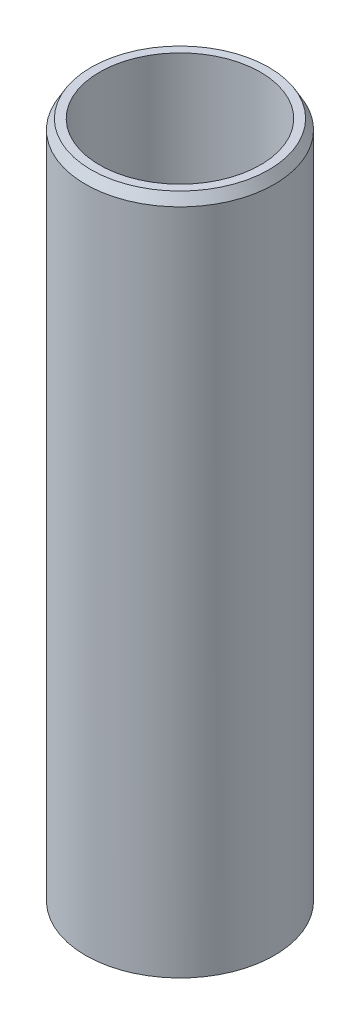
ISO-10303-21;
HEADER;
FILE_DESCRIPTION(('STEP AP214'),'2;1');
FILE_NAME('part.step','',(''),(''),'','','');
FILE_SCHEMA(('AUTOMOTIVE_DESIGN { 1 0 10303 214 1 1 1 1 }'));
ENDSEC;
DATA;
#1=APPLICATION_CONTEXT('core data for automotive mechanical design processes');
#2=APPLICATION_PROTOCOL_DEFINITION('international standard','automotive_design',2000,#1);
#3=PRODUCT_CONTEXT('',#1,'mechanical');
#4=PRODUCT('Part','Part','',(#3));
#5=PRODUCT_RELATED_PRODUCT_CATEGORY('part','',(#4));
#6=PRODUCT_DEFINITION_FORMATION('','',#4);
#7=PRODUCT_DEFINITION_CONTEXT('part definition',#1,'design');
#8=PRODUCT_DEFINITION('design','',#6,#7);
#9=PRODUCT_DEFINITION_SHAPE('','',#8);
#10=(LENGTH_UNIT() NAMED_UNIT(*) SI_UNIT(.MILLI.,.METRE.));
#11=(NAMED_UNIT(*) PLANE_ANGLE_UNIT() SI_UNIT($,.RADIAN.));
#12=(NAMED_UNIT(*) SI_UNIT($,.STERADIAN.) SOLID_ANGLE_UNIT());
#13=UNCERTAINTY_MEASURE_WITH_UNIT(LENGTH_MEASURE(1.E-05),#10,'distance_accuracy_value','');
#14=(GEOMETRIC_REPRESENTATION_CONTEXT(3) GLOBAL_UNCERTAINTY_ASSIGNED_CONTEXT((#13)) GLOBAL_UNIT_ASSIGNED_CONTEXT((#10,
#11,#12)) REPRESENTATION_CONTEXT('',''));
#15=CARTESIAN_POINT('',(0.,0.,0.));
#16=DIRECTION('',(0.,0.,1.));
#17=DIRECTION('',(1.,0.,0.));
#18=AXIS2_PLACEMENT_3D('',#15,#16,#17);
#19=CARTESIAN_POINT('',(0.,307.359399518513,0.));
#20=DIRECTION('',(0.,-1.,0.));
#21=DIRECTION('',(0.,0.,-1.));
#22=AXIS2_PLACEMENT_3D('',#19,#20,#21);
#23=CYLINDRICAL_SURFACE('',#22,42.5);
#24=CARTESIAN_POINT('',(0.,302.978936615049,0.));
#25=DIRECTION('',(0.,1.,0.));
#26=DIRECTION('',(0.,0.,1.));
#27=AXIS2_PLACEMENT_3D('',#24,#25,#26);
#28=CIRCLE('',#27,42.5);
#29=CARTESIAN_POINT('',(0.,302.978936615049,-42.5));
#30=VERTEX_POINT('',#29);
#31=EDGE_CURVE('E50',#30,#30,#28,.F.);
#32=CARTESIAN_POINT('',(0.,2.52906143649057,0.));
#33=DIRECTION('',(0.,1.,0.));
#34=DIRECTION('',(0.,0.,1.));
#35=AXIS2_PLACEMENT_3D('',#32,#33,#34);
#36=CIRCLE('',#35,42.5);
#37=CARTESIAN_POINT('',(0.,2.52906143649051,-42.5));
#38=VERTEX_POINT('',#37);
#39=EDGE_CURVE('E51',#38,#38,#36,.T.);
#40=CARTESIAN_POINT('',(0.,302.978936615049,-42.5));
#41=CARTESIAN_POINT('',(0.,299.849250415272,-42.5));
#42=CARTESIAN_POINT('',(0.,296.719564215496,-42.5));
#43=CARTESIAN_POINT('',(0.,290.460191815942,-42.5));
#44=CARTESIAN_POINT('',(0.,287.330505616166,-42.5));
#45=CARTESIAN_POINT('',(0.,281.071133216613,-42.5));
#46=CARTESIAN_POINT('',(0.,277.941447016836,-42.5));
#47=CARTESIAN_POINT('',(0.,271.682074617283,-42.5));
#48=CARTESIAN_POINT('',(0.,268.552388417506,-42.5));
#49=CARTESIAN_POINT('',(0.,262.293016017953,-42.5));
#50=CARTESIAN_POINT('',(0.,259.163329818176,-42.5));
#51=CARTESIAN_POINT('',(0.,252.903957418623,-42.5));
#52=CARTESIAN_POINT('',(0.,249.774271218846,-42.5));
#53=CARTESIAN_POINT('',(0.,243.514898819293,-42.5));
#54=CARTESIAN_POINT('',(0.,240.385212619516,-42.5));
#55=CARTESIAN_POINT('',(0.,234.125840219963,-42.5));
#56=CARTESIAN_POINT('',(0.,230.996154020186,-42.5));
#57=CARTESIAN_POINT('',(0.,224.736781620633,-42.5));
#58=CARTESIAN_POINT('',(0.,221.607095420856,-42.5));
#59=CARTESIAN_POINT('',(0.,215.347723021303,-42.5));
#60=CARTESIAN_POINT('',(0.,212.218036821526,-42.5));
#61=CARTESIAN_POINT('',(0.,205.958664421973,-42.5));
#62=CARTESIAN_POINT('',(0.,202.828978222196,-42.5));
#63=CARTESIAN_POINT('',(0.,196.569605822643,-42.5));
#64=CARTESIAN_POINT('',(0.,193.439919622866,-42.5));
#65=CARTESIAN_POINT('',(0.,187.180547223313,-42.5));
#66=CARTESIAN_POINT('',(0.,184.050861023536,-42.5));
#67=CARTESIAN_POINT('',(0.,177.791488623983,-42.5));
#68=CARTESIAN_POINT('',(0.,174.661802424206,-42.5));
#69=CARTESIAN_POINT('',(0.,168.402430024653,-42.5));
#70=CARTESIAN_POINT('',(0.,165.272743824876,-42.5));
#71=CARTESIAN_POINT('',(0.,159.013371425323,-42.5));
#72=CARTESIAN_POINT('',(0.,155.883685225546,-42.5));
#73=CARTESIAN_POINT('',(0.,149.624312825993,-42.5));
#74=CARTESIAN_POINT('',(0.,146.494626626217,-42.5));
#75=CARTESIAN_POINT('',(0.,140.235254226663,-42.5));
#76=CARTESIAN_POINT('',(0.,137.105568026887,-42.5));
#77=CARTESIAN_POINT('',(0.,130.846195627333,-42.5));
#78=CARTESIAN_POINT('',(0.,127.716509427557,-42.5));
#79=CARTESIAN_POINT('',(0.,121.457137028003,-42.5));
#80=CARTESIAN_POINT('',(0.,118.327450828227,-42.5));
#81=CARTESIAN_POINT('',(0.,112.068078428673,-42.5));
#82=CARTESIAN_POINT('',(0.,108.938392228897,-42.5));
#83=CARTESIAN_POINT('',(0.,102.679019829343,-42.5));
#84=CARTESIAN_POINT('',(0.,99.5493336295667,-42.5));
#85=CARTESIAN_POINT('',(0.,93.2899612300134,-42.5));
#86=CARTESIAN_POINT('',(0.,90.1602750302368,-42.5));
#87=CARTESIAN_POINT('',(0.,83.9009026306835,-42.5));
#88=CARTESIAN_POINT('',(0.,80.7712164309068,-42.5));
#89=CARTESIAN_POINT('',(0.,74.5118440313535,-42.5));
#90=CARTESIAN_POINT('',(0.,71.3821578315769,-42.5));
#91=CARTESIAN_POINT('',(0.,65.1227854320236,-42.5));
#92=CARTESIAN_POINT('',(0.,61.9930992322469,-42.5));
#93=CARTESIAN_POINT('',(0.,55.7337268326936,-42.5));
#94=CARTESIAN_POINT('',(0.,52.604040632917,-42.5));
#95=CARTESIAN_POINT('',(0.,46.3446682333636,-42.5));
#96=CARTESIAN_POINT('',(0.,43.214982033587,-42.5));
#97=CARTESIAN_POINT('',(0.,36.9556096340337,-42.5));
#98=CARTESIAN_POINT('',(0.,33.825923434257,-42.5));
#99=CARTESIAN_POINT('',(0.,27.5665510347037,-42.5));
#100=CARTESIAN_POINT('',(0.,24.4368648349271,-42.5));
#101=CARTESIAN_POINT('',(0.,18.1774924353738,-42.5));
#102=CARTESIAN_POINT('',(0.,15.0478062355971,-42.5));
#103=CARTESIAN_POINT('',(0.,8.78843383604383,-42.5));
#104=CARTESIAN_POINT('',(0.,5.65874763626717,-42.5));
#105=CARTESIAN_POINT('',(0.,2.52906143649051,-42.5));
#106=B_SPLINE_CURVE_WITH_KNOTS('',3,(#40,#41,#42,#43,#44,#45,#46,#47,#48,#49,#50,#51,#52,#53,
#54,#55,#56,#57,#58,#59,#60,#61,#62,#63,#64,#65,#66,#67,#68,#69,#70,#71,#72,#73,#74,#75,#76,#77,
#78,#79,#80,#81,#82,#83,#84,#85,#86,#87,#88,#89,#90,#91,#92,#93,#94,#95,#96,#97,#98,#99,#100,
#101,#102,#103,#104,#105),.UNSPECIFIED.,.F.,.F.,(4,2,2,2,2,2,2,2,2,2,2,2,2,2,2,2,2,2,2,2,2,2,2,
2,2,2,2,2,2,2,2,2,4),(0.,9.38905859932992,18.7781171986599,28.1671757979898,37.5562343973198,
46.9452929966497,56.3343515959797,65.7234101953097,75.1124687946396,84.5015273939696,
93.8905859932995,103.27964459263,112.668703191959,122.057761791289,131.446820390619,
140.835878989949,150.224937589279,159.613996188609,169.003054787939,178.392113387269,
187.781171986599,197.170230585929,206.559289185259,215.948347784589,225.337406383919,
234.726464983249,244.115523582579,253.504582181909,262.893640781239,272.282699380569,
281.671757979899,291.060816579229,300.449875178559),.UNSPECIFIED.);
#107=EDGE_CURVE('BSEAM39',#30,#38,#106,.T.);
#108=ORIENTED_EDGE('',*,*,#31,.T.);
#109=ORIENTED_EDGE('',*,*,#39,.T.);
#110=ORIENTED_EDGE('',*,*,#107,.T.);
#111=ORIENTED_EDGE('',*,*,#107,.F.);
#112=EDGE_LOOP('',(#108,#110,#109,#111));
#113=FACE_BOUND('',#112,.T.);
#114=ADVANCED_FACE('F39',(#113),#23,.T.);
#115=CARTESIAN_POINT('',(0.,307.359399518513,0.));
#116=DIRECTION('',(0.,1.,0.));
#117=DIRECTION('',(0.,0.,1.));
#118=AXIS2_PLACEMENT_3D('',#115,#116,#117);
#119=PLANE('',#118);
#120=CARTESIAN_POINT('',(0.,307.359399518513,0.));
#121=DIRECTION('',(0.,1.,0.));
#122=DIRECTION('',(0.,0.,1.));
#123=AXIS2_PLACEMENT_3D('',#120,#121,#122);
#124=CIRCLE('',#123,39.9709385635099);
#125=CARTESIAN_POINT('',(0.,307.359399518513,39.9709385635099));
#126=VERTEX_POINT('',#125);
#127=EDGE_CURVE('E54',#126,#126,#124,.T.);
#128=ORIENTED_EDGE('',*,*,#127,.T.);
#129=EDGE_LOOP('',(#128));
#130=FACE_BOUND('',#129,.T.);
#131=CARTESIAN_POINT('',(0.,307.359399518513,0.));
#132=DIRECTION('',(0.,1.,0.));
#133=DIRECTION('',(0.,0.,1.));
#134=AXIS2_PLACEMENT_3D('',#131,#132,#133);
#135=CIRCLE('',#134,36.1983641459943);
#136=CARTESIAN_POINT('',(0.,307.359399518513,-36.1983641459943));
#137=VERTEX_POINT('',#136);
#138=EDGE_CURVE('E58',#137,#137,#135,.T.);
#139=ORIENTED_EDGE('',*,*,#138,.F.);
#140=EDGE_LOOP('',(#139));
#141=FACE_BOUND('',#140,.T.);
#142=ADVANCED_FACE('F69',(#130,#141),#119,.T.);
#143=CARTESIAN_POINT('',(0.,0.,0.));
#144=DIRECTION('',(0.,1.,0.));
#145=DIRECTION('',(0.,0.,1.));
#146=AXIS2_PLACEMENT_3D('',#143,#144,#145);
#147=PLANE('',#146);
#148=CARTESIAN_POINT('',(0.,0.,0.));
#149=DIRECTION('',(0.,1.,0.));
#150=DIRECTION('',(0.,0.,1.));
#151=AXIS2_PLACEMENT_3D('',#148,#149,#150);
#152=CIRCLE('',#151,38.1195370965352);
#153=CARTESIAN_POINT('',(0.,0.,38.1195370965352));
#154=VERTEX_POINT('',#153);
#155=EDGE_CURVE('E10',#154,#154,#152,.F.);
#156=ORIENTED_EDGE('',*,*,#155,.T.);
#157=EDGE_LOOP('',(#156));
#158=FACE_BOUND('',#157,.T.);
#159=CARTESIAN_POINT('',(0.,0.,0.));
#160=DIRECTION('',(0.,1.,0.));
#161=DIRECTION('',(0.,0.,1.));
#162=AXIS2_PLACEMENT_3D('',#159,#160,#161);
#163=CIRCLE('',#162,36.1983641459943);
#164=CARTESIAN_POINT('',(0.,0.,-36.1983641459943));
#165=VERTEX_POINT('',#164);
#166=EDGE_CURVE('E63',#165,#165,#163,.T.);
#167=ORIENTED_EDGE('',*,*,#166,.T.);
#168=EDGE_LOOP('',(#167));
#169=FACE_BOUND('',#168,.T.);
#170=ADVANCED_FACE('F75',(#158,#169),#147,.F.);
#171=CARTESIAN_POINT('',(0.,307.359399518513,0.));
#172=DIRECTION('',(0.,-1.,0.));
#173=DIRECTION('',(0.,0.,-1.));
#174=AXIS2_PLACEMENT_3D('',#171,#172,#173);
#175=CYLINDRICAL_SURFACE('',#174,36.1983641459943);
#176=CARTESIAN_POINT('',(0.,307.359399518513,-36.1983641459943));
#177=CARTESIAN_POINT('',(0.,304.157739106862,-36.1983641459943));
#178=CARTESIAN_POINT('',(0.,300.956078695211,-36.1983641459943));
#179=CARTESIAN_POINT('',(0.,294.552757871909,-36.1983641459943));
#180=CARTESIAN_POINT('',(0.,291.351097460257,-36.1983641459943));
#181=CARTESIAN_POINT('',(0.,284.947776636955,-36.1983641459943));
#182=CARTESIAN_POINT('',(0.,281.746116225304,-36.1983641459943));
#183=CARTESIAN_POINT('',(0.,275.342795402001,-36.1983641459943));
#184=CARTESIAN_POINT('',(0.,272.14113499035,-36.1983641459943));
#185=CARTESIAN_POINT('',(0.,265.737814167048,-36.1983641459943));
#186=CARTESIAN_POINT('',(0.,262.536153755397,-36.1983641459943));
#187=CARTESIAN_POINT('',(0.,256.132832932094,-36.1983641459943));
#188=CARTESIAN_POINT('',(0.,252.931172520443,-36.1983641459943));
#189=CARTESIAN_POINT('',(0.,246.527851697141,-36.1983641459943));
#190=CARTESIAN_POINT('',(0.,243.32619128549,-36.1983641459943));
#191=CARTESIAN_POINT('',(0.,236.922870462187,-36.1983641459943));
#192=CARTESIAN_POINT('',(0.,233.721210050536,-36.1983641459943));
#193=CARTESIAN_POINT('',(0.,227.317889227234,-36.1983641459943));
#194=CARTESIAN_POINT('',(0.,224.116228815583,-36.1983641459943));
#195=CARTESIAN_POINT('',(0.,217.71290799228,-36.1983641459943));
#196=CARTESIAN_POINT('',(0.,214.511247580629,-36.1983641459943));
#197=CARTESIAN_POINT('',(0.,208.107926757327,-36.1983641459943));
#198=CARTESIAN_POINT('',(0.,204.906266345675,-36.1983641459943));
#199=CARTESIAN_POINT('',(0.,198.502945522373,-36.1983641459943));
#200=CARTESIAN_POINT('',(0.,195.301285110722,-36.1983641459943));
#201=CARTESIAN_POINT('',(0.,188.89796428742,-36.1983641459943));
#202=CARTESIAN_POINT('',(0.,185.696303875768,-36.1983641459943));
#203=CARTESIAN_POINT('',(0.,179.292983052466,-36.1983641459943));
#204=CARTESIAN_POINT('',(0.,176.091322640815,-36.1983641459943));
#205=CARTESIAN_POINT('',(0.,169.688001817512,-36.1983641459943));
#206=CARTESIAN_POINT('',(0.,166.486341405861,-36.1983641459943));
#207=CARTESIAN_POINT('',(0.,160.083020582559,-36.1983641459943));
#208=CARTESIAN_POINT('',(0.,156.881360170908,-36.1983641459943));
#209=CARTESIAN_POINT('',(0.,150.478039347605,-36.1983641459943));
#210=CARTESIAN_POINT('',(0.,147.276378935954,-36.1983641459943));
#211=CARTESIAN_POINT('',(0.,140.873058112652,-36.1983641459943));
#212=CARTESIAN_POINT('',(0.,137.671397701001,-36.1983641459943));
#213=CARTESIAN_POINT('',(0.,131.268076877698,-36.1983641459943));
#214=CARTESIAN_POINT('',(0.,128.066416466047,-36.1983641459943));
#215=CARTESIAN_POINT('',(0.,121.663095642745,-36.1983641459943));
#216=CARTESIAN_POINT('',(0.,118.461435231094,-36.1983641459943));
#217=CARTESIAN_POINT('',(0.,112.058114407791,-36.1983641459943));
#218=CARTESIAN_POINT('',(0.,108.85645399614,-36.1983641459943));
#219=CARTESIAN_POINT('',(0.,102.453133172838,-36.1983641459943));
#220=CARTESIAN_POINT('',(0.,99.2514727611865,-36.1983641459943));
#221=CARTESIAN_POINT('',(0.,92.8481519378841,-36.1983641459943));
#222=CARTESIAN_POINT('',(0.,89.6464915262329,-36.1983641459943));
#223=CARTESIAN_POINT('',(0.,83.2431707029306,-36.1983641459943));
#224=CARTESIAN_POINT('',(0.,80.0415102912794,-36.1983641459943));
#225=CARTESIAN_POINT('',(0.,73.638189467977,-36.1983641459943));
#226=CARTESIAN_POINT('',(0.,70.4365290563259,-36.1983641459943));
#227=CARTESIAN_POINT('',(0.,64.0332082330235,-36.1983641459943));
#228=CARTESIAN_POINT('',(0.,60.8315478213723,-36.1983641459943));
#229=CARTESIAN_POINT('',(0.,54.42822699807,-36.1983641459943));
#230=CARTESIAN_POINT('',(0.,51.2265665864188,-36.1983641459943));
#231=CARTESIAN_POINT('',(0.,44.8232457631165,-36.1983641459943));
#232=CARTESIAN_POINT('',(0.,41.6215853514653,-36.1983641459943));
#233=CARTESIAN_POINT('',(0.,35.2182645281629,-36.1983641459943));
#234=CARTESIAN_POINT('',(0.,32.0166041165117,-36.1983641459943));
#235=CARTESIAN_POINT('',(0.,25.6132832932094,-36.1983641459943));
#236=CARTESIAN_POINT('',(0.,22.4116228815582,-36.1983641459943));
#237=CARTESIAN_POINT('',(0.,16.0083020582559,-36.1983641459943));
#238=CARTESIAN_POINT('',(0.,12.8066416466047,-36.1983641459943));
#239=CARTESIAN_POINT('',(0.,6.40332082330233,-36.1983641459943));
#240=CARTESIAN_POINT('',(0.,3.20166041165114,-36.1983641459943));
#241=CARTESIAN_POINT('',(0.,0.,-36.1983641459943));
#242=B_SPLINE_CURVE_WITH_KNOTS('',3,(#176,#177,#178,#179,#180,#181,#182,#183,#184,#185,#186,
#187,#188,#189,#190,#191,#192,#193,#194,#195,#196,#197,#198,#199,#200,#201,#202,#203,#204,#205,
#206,#207,#208,#209,#210,#211,#212,#213,#214,#215,#216,#217,#218,#219,#220,#221,#222,#223,#224,
#225,#226,#227,#228,#229,#230,#231,#232,#233,#234,#235,#236,#237,#238,#239,#240,#241),
.UNSPECIFIED.,.F.,.F.,(4,2,2,2,2,2,2,2,2,2,2,2,2,2,2,2,2,2,2,2,2,2,2,2,2,2,2,2,2,2,2,2,4),(0.,
9.60498123495357,19.2099624699071,28.8149437048607,38.4199249398142,48.0249061747677,
57.6298874097213,67.2348686446748,76.8398498796283,86.4448311145819,96.0498123495354,
105.654793584489,115.259774819442,124.864756054396,134.46973728935,144.074718524303,
153.679699759257,163.28468099421,172.889662229164,182.494643464117,192.099624699071,
201.704605934024,211.309587168978,220.914568403931,230.519549638885,240.124530873839,
249.729512108792,259.334493343746,268.939474578699,278.544455813653,288.149437048606,
297.75441828356,307.359399518513),.UNSPECIFIED.);
#243=EDGE_CURVE('BSEAM70',#137,#165,#242,.T.);
#244=ORIENTED_EDGE('',*,*,#138,.T.);
#245=ORIENTED_EDGE('',*,*,#166,.F.);
#246=ORIENTED_EDGE('',*,*,#243,.T.);
#247=ORIENTED_EDGE('',*,*,#243,.F.);
#248=EDGE_LOOP('',(#244,#246,#245,#247));
#249=FACE_BOUND('',#248,.T.);
#250=ADVANCED_FACE('F70',(#249),#175,.F.);
#251=CARTESIAN_POINT('',(0.,307.359399518513,0.));
#252=DIRECTION('',(0.,-1.,0.));
#253=DIRECTION('',(0.,0.,-1.));
#254=AXIS2_PLACEMENT_3D('',#251,#252,#253);
#255=CONICAL_SURFACE('',#254,39.9709385635099,0.523598775598296);
#256=ORIENTED_EDGE('',*,*,#31,.F.);
#257=EDGE_LOOP('',(#256));
#258=FACE_BOUND('',#257,.T.);
#259=ORIENTED_EDGE('',*,*,#127,.F.);
#260=EDGE_LOOP('',(#259));
#261=FACE_BOUND('',#260,.T.);
#262=ADVANCED_FACE('F81',(#258,#261),#255,.T.);
#263=CARTESIAN_POINT('',(0.,2.52906143649057,0.));
#264=DIRECTION('',(0.,1.,0.));
#265=DIRECTION('',(0.,0.,1.));
#266=AXIS2_PLACEMENT_3D('',#263,#264,#265);
#267=CONICAL_SURFACE('',#266,42.5,1.0471975511966);
#268=ORIENTED_EDGE('',*,*,#155,.F.);
#269=EDGE_LOOP('',(#268));
#270=FACE_BOUND('',#269,.T.);
#271=ORIENTED_EDGE('',*,*,#39,.F.);
#272=EDGE_LOOP('',(#271));
#273=FACE_BOUND('',#272,.T.);
#274=ADVANCED_FACE('F45',(#270,#273),#267,.T.);
#275=CLOSED_SHELL('',(#114,#142,#170,#250,#262,#274));
#276=MANIFOLD_SOLID_BREP('B2',#275);
#277=ADVANCED_BREP_SHAPE_REPRESENTATION('',(#18,#276),#14);
#278=SHAPE_DEFINITION_REPRESENTATION(#9,#277);
ENDSEC;
END-ISO-10303-21;
